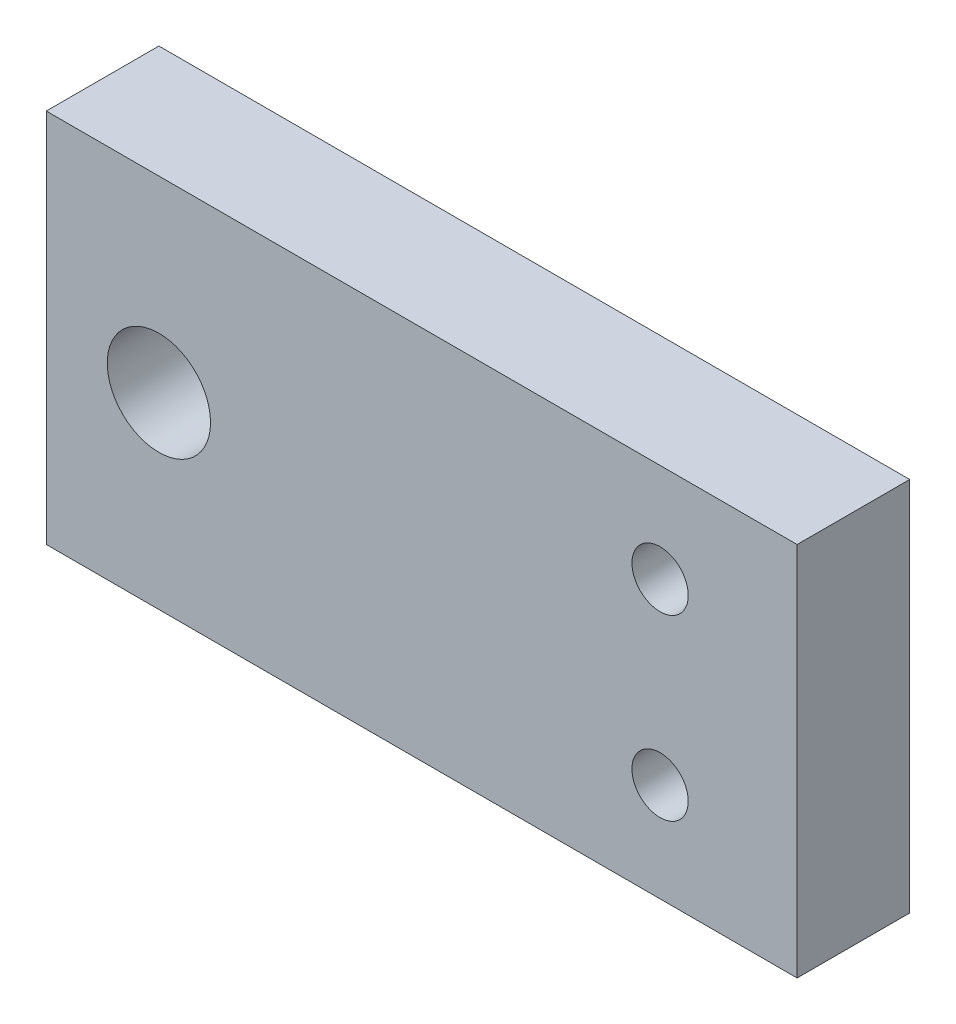
ISO-10303-21;
HEADER;
FILE_DESCRIPTION(('STEP AP214'),'2;1');
FILE_NAME('part.step','',(''),(''),'','','');
FILE_SCHEMA(('AUTOMOTIVE_DESIGN { 1 0 10303 214 1 1 1 1 }'));
ENDSEC;
DATA;
#1=APPLICATION_CONTEXT('core data for automotive mechanical design processes');
#2=APPLICATION_PROTOCOL_DEFINITION('international standard','automotive_design',2000,#1);
#3=PRODUCT_CONTEXT('',#1,'mechanical');
#4=PRODUCT('Part','Part','',(#3));
#5=PRODUCT_RELATED_PRODUCT_CATEGORY('part','',(#4));
#6=PRODUCT_DEFINITION_FORMATION('','',#4);
#7=PRODUCT_DEFINITION_CONTEXT('part definition',#1,'design');
#8=PRODUCT_DEFINITION('design','',#6,#7);
#9=PRODUCT_DEFINITION_SHAPE('','',#8);
#10=(LENGTH_UNIT() NAMED_UNIT(*) SI_UNIT(.MILLI.,.METRE.));
#11=(NAMED_UNIT(*) PLANE_ANGLE_UNIT() SI_UNIT($,.RADIAN.));
#12=(NAMED_UNIT(*) SI_UNIT($,.STERADIAN.) SOLID_ANGLE_UNIT());
#13=UNCERTAINTY_MEASURE_WITH_UNIT(LENGTH_MEASURE(1.E-05),#10,'distance_accuracy_value','');
#14=(GEOMETRIC_REPRESENTATION_CONTEXT(3) GLOBAL_UNCERTAINTY_ASSIGNED_CONTEXT((#13)) GLOBAL_UNIT_ASSIGNED_CONTEXT((#10,
#11,#12)) REPRESENTATION_CONTEXT('',''));
#15=CARTESIAN_POINT('',(0.,0.,0.));
#16=DIRECTION('',(0.,0.,1.));
#17=DIRECTION('',(1.,0.,0.));
#18=AXIS2_PLACEMENT_3D('',#15,#16,#17);
#19=CARTESIAN_POINT('',(32.7,-4.75000000000001,-1.5));
#20=DIRECTION('',(0.,0.,1.));
#21=DIRECTION('',(1.,0.,0.));
#22=AXIS2_PLACEMENT_3D('',#19,#20,#21);
#23=CYLINDRICAL_SURFACE('',#22,1.5);
#24=CARTESIAN_POINT('',(32.7,-4.75000000000001,6.));
#25=DIRECTION('',(0.,0.,1.));
#26=DIRECTION('',(1.,0.,0.));
#27=AXIS2_PLACEMENT_3D('',#24,#25,#26);
#28=CIRCLE('',#27,1.5);
#29=CARTESIAN_POINT('',(34.2,-4.75000000000001,6.));
#30=VERTEX_POINT('',#29);
#31=EDGE_CURVE('E273',#30,#30,#28,.T.);
#32=ORIENTED_EDGE('',*,*,#31,.T.);
#33=EDGE_LOOP('',(#32));
#34=FACE_BOUND('',#33,.T.);
#35=CARTESIAN_POINT('',(32.7,-4.75000000000001,2.));
#36=DIRECTION('',(0.,0.,-1.));
#37=DIRECTION('',(-1.,0.,0.));
#38=AXIS2_PLACEMENT_3D('',#35,#36,#37);
#39=CIRCLE('',#38,1.5);
#40=CARTESIAN_POINT('',(31.2,-4.75000000000001,2.));
#41=VERTEX_POINT('',#40);
#42=EDGE_CURVE('E36',#41,#41,#39,.F.);
#43=ORIENTED_EDGE('',*,*,#42,.F.);
#44=EDGE_LOOP('',(#43));
#45=FACE_BOUND('',#44,.T.);
#46=ADVANCED_FACE('F32',(#34,#45),#23,.F.);
#47=CARTESIAN_POINT('',(32.7,4.74999999999999,-1.5));
#48=DIRECTION('',(0.,0.,1.));
#49=DIRECTION('',(1.,0.,0.));
#50=AXIS2_PLACEMENT_3D('',#47,#48,#49);
#51=CYLINDRICAL_SURFACE('',#50,1.5);
#52=CARTESIAN_POINT('',(32.7,4.74999999999999,6.));
#53=DIRECTION('',(0.,0.,1.));
#54=DIRECTION('',(1.,0.,0.));
#55=AXIS2_PLACEMENT_3D('',#52,#53,#54);
#56=CIRCLE('',#55,1.5);
#57=CARTESIAN_POINT('',(34.2,4.74999999999999,6.));
#58=VERTEX_POINT('',#57);
#59=EDGE_CURVE('E276',#58,#58,#56,.T.);
#60=ORIENTED_EDGE('',*,*,#59,.T.);
#61=EDGE_LOOP('',(#60));
#62=FACE_BOUND('',#61,.T.);
#63=CARTESIAN_POINT('',(32.7,4.74999999999999,2.));
#64=DIRECTION('',(0.,0.,-1.));
#65=DIRECTION('',(-1.,0.,0.));
#66=AXIS2_PLACEMENT_3D('',#63,#64,#65);
#67=CIRCLE('',#66,1.5);
#68=CARTESIAN_POINT('',(31.2,4.74999999999999,2.));
#69=VERTEX_POINT('',#68);
#70=EDGE_CURVE('E263',#69,#69,#67,.F.);
#71=ORIENTED_EDGE('',*,*,#70,.F.);
#72=EDGE_LOOP('',(#71));
#73=FACE_BOUND('',#72,.T.);
#74=ADVANCED_FACE('F348',(#62,#73),#51,.F.);
#75=CARTESIAN_POINT('',(0.,0.,0.));
#76=DIRECTION('',(0.,0.,1.));
#77=DIRECTION('',(1.,0.,0.));
#78=AXIS2_PLACEMENT_3D('',#75,#76,#77);
#79=PLANE('',#78);
#80=DIRECTION('',(0.500000000000001,0.866025403784438,0.));
#81=VECTOR('',#80,1.);
#82=CARTESIAN_POINT('',(29.5245735194571,-4.75000000000001,0.));
#83=LINE('',#82,#81);
#84=CARTESIAN_POINT('',(29.5245735194571,-4.75000000000001,0.));
#85=VERTEX_POINT('',#84);
#86=CARTESIAN_POINT('',(31.1122867597285,-2.00000000000001,0.));
#87=VERTEX_POINT('',#86);
#88=EDGE_CURVE('E207',#85,#87,#83,.T.);
#89=ORIENTED_EDGE('',*,*,#88,.F.);
#90=DIRECTION('',(-0.5,0.866025403784439,0.));
#91=VECTOR('',#90,1.);
#92=CARTESIAN_POINT('',(31.1122867597285,-7.50000000000002,0.));
#93=LINE('',#92,#91);
#94=CARTESIAN_POINT('',(31.1122867597285,-7.50000000000002,0.));
#95=VERTEX_POINT('',#94);
#96=EDGE_CURVE('E49',#95,#85,#93,.T.);
#97=ORIENTED_EDGE('',*,*,#96,.F.);
#98=DIRECTION('',(-1.,0.,0.));
#99=VECTOR('',#98,1.);
#100=CARTESIAN_POINT('',(34.2877132402715,-7.50000000000002,0.));
#101=LINE('',#100,#99);
#102=CARTESIAN_POINT('',(34.2877132402715,-7.50000000000002,0.));
#103=VERTEX_POINT('',#102);
#104=EDGE_CURVE('E193',#103,#95,#101,.T.);
#105=ORIENTED_EDGE('',*,*,#104,.F.);
#106=DIRECTION('',(-0.5,-0.866025403784439,0.));
#107=VECTOR('',#106,1.);
#108=CARTESIAN_POINT('',(35.875426480543,-4.75000000000001,0.));
#109=LINE('',#108,#107);
#110=CARTESIAN_POINT('',(35.875426480543,-4.75000000000001,0.));
#111=VERTEX_POINT('',#110);
#112=EDGE_CURVE('E196',#111,#103,#109,.T.);
#113=ORIENTED_EDGE('',*,*,#112,.F.);
#114=DIRECTION('',(0.499999999999999,-0.866025403784439,0.));
#115=VECTOR('',#114,1.);
#116=CARTESIAN_POINT('',(34.2877132402715,-2.00000000000001,0.));
#117=LINE('',#116,#115);
#118=CARTESIAN_POINT('',(34.2877132402715,-2.00000000000001,0.));
#119=VERTEX_POINT('',#118);
#120=EDGE_CURVE('E212',#119,#111,#117,.T.);
#121=ORIENTED_EDGE('',*,*,#120,.F.);
#122=DIRECTION('',(1.,0.,0.));
#123=VECTOR('',#122,1.);
#124=CARTESIAN_POINT('',(31.1122867597285,-2.00000000000001,0.));
#125=LINE('',#124,#123);
#126=EDGE_CURVE('E209',#87,#119,#125,.T.);
#127=ORIENTED_EDGE('',*,*,#126,.F.);
#128=EDGE_LOOP('',(#89,#97,#105,#113,#121,#127));
#129=FACE_BOUND('',#128,.T.);
#130=DIRECTION('',(0.5,0.866025403784439,0.));
#131=VECTOR('',#130,1.);
#132=CARTESIAN_POINT('',(29.5245735194571,4.74999999999999,0.));
#133=LINE('',#132,#131);
#134=CARTESIAN_POINT('',(29.5245735194571,4.74999999999998,0.));
#135=VERTEX_POINT('',#134);
#136=CARTESIAN_POINT('',(31.1122867597285,7.49999999999999,0.));
#137=VERTEX_POINT('',#136);
#138=EDGE_CURVE('E247',#135,#137,#133,.T.);
#139=ORIENTED_EDGE('',*,*,#138,.F.);
#140=DIRECTION('',(-0.499999999999999,0.866025403784439,0.));
#141=VECTOR('',#140,1.);
#142=CARTESIAN_POINT('',(31.1122867597285,1.99999999999999,0.));
#143=LINE('',#142,#141);
#144=CARTESIAN_POINT('',(31.1122867597285,1.99999999999999,0.));
#145=VERTEX_POINT('',#144);
#146=EDGE_CURVE('E57',#145,#135,#143,.T.);
#147=ORIENTED_EDGE('',*,*,#146,.F.);
#148=DIRECTION('',(-1.,0.,0.));
#149=VECTOR('',#148,1.);
#150=CARTESIAN_POINT('',(34.2877132402715,1.99999999999999,0.));
#151=LINE('',#150,#149);
#152=CARTESIAN_POINT('',(34.2877132402715,1.99999999999999,0.));
#153=VERTEX_POINT('',#152);
#154=EDGE_CURVE('E230',#153,#145,#151,.T.);
#155=ORIENTED_EDGE('',*,*,#154,.F.);
#156=DIRECTION('',(-0.500000000000002,-0.866025403784438,0.));
#157=VECTOR('',#156,1.);
#158=CARTESIAN_POINT('',(35.875426480543,4.74999999999998,0.));
#159=LINE('',#158,#157);
#160=CARTESIAN_POINT('',(35.875426480543,4.74999999999998,0.));
#161=VERTEX_POINT('',#160);
#162=EDGE_CURVE('E256',#161,#153,#159,.T.);
#163=ORIENTED_EDGE('',*,*,#162,.F.);
#164=DIRECTION('',(0.500000000000002,-0.866025403784437,0.));
#165=VECTOR('',#164,1.);
#166=CARTESIAN_POINT('',(34.2877132402715,7.49999999999999,0.));
#167=LINE('',#166,#165);
#168=CARTESIAN_POINT('',(34.2877132402715,7.49999999999999,0.));
#169=VERTEX_POINT('',#168);
#170=EDGE_CURVE('E253',#169,#161,#167,.T.);
#171=ORIENTED_EDGE('',*,*,#170,.F.);
#172=DIRECTION('',(1.,0.,0.));
#173=VECTOR('',#172,1.);
#174=CARTESIAN_POINT('',(31.1122867597285,7.49999999999999,0.));
#175=LINE('',#174,#173);
#176=EDGE_CURVE('E250',#137,#169,#175,.T.);
#177=ORIENTED_EDGE('',*,*,#176,.F.);
#178=EDGE_LOOP('',(#139,#147,#155,#163,#171,#177));
#179=FACE_BOUND('',#178,.T.);
#180=CARTESIAN_POINT('',(6.,0.,0.));
#181=DIRECTION('',(0.,0.,1.));
#182=DIRECTION('',(1.,0.,0.));
#183=AXIS2_PLACEMENT_3D('',#180,#181,#182);
#184=CIRCLE('',#183,2.75);
#185=CARTESIAN_POINT('',(8.75,0.,0.));
#186=VERTEX_POINT('',#185);
#187=EDGE_CURVE('E282',#186,#186,#184,.T.);
#188=ORIENTED_EDGE('',*,*,#187,.T.);
#189=EDGE_LOOP('',(#188));
#190=FACE_BOUND('',#189,.T.);
#191=DIRECTION('',(0.,-1.,0.));
#192=VECTOR('',#191,1.);
#193=CARTESIAN_POINT('',(0.,10.,0.));
#194=LINE('',#193,#192);
#195=CARTESIAN_POINT('',(0.,10.,0.));
#196=VERTEX_POINT('',#195);
#197=CARTESIAN_POINT('',(0.,-10.,0.));
#198=VERTEX_POINT('',#197);
#199=EDGE_CURVE('E318',#196,#198,#194,.T.);
#200=ORIENTED_EDGE('',*,*,#199,.F.);
#201=DIRECTION('',(-1.,0.,0.));
#202=VECTOR('',#201,1.);
#203=CARTESIAN_POINT('',(0.,10.,0.));
#204=LINE('',#203,#202);
#205=CARTESIAN_POINT('',(40.,10.,0.));
#206=VERTEX_POINT('',#205);
#207=EDGE_CURVE('E323',#206,#196,#204,.T.);
#208=ORIENTED_EDGE('',*,*,#207,.F.);
#209=DIRECTION('',(0.,1.,0.));
#210=VECTOR('',#209,1.);
#211=CARTESIAN_POINT('',(40.,10.,0.));
#212=LINE('',#211,#210);
#213=CARTESIAN_POINT('',(40.,-10.,0.));
#214=VERTEX_POINT('',#213);
#215=EDGE_CURVE('E334',#214,#206,#212,.T.);
#216=ORIENTED_EDGE('',*,*,#215,.F.);
#217=DIRECTION('',(1.,0.,0.));
#218=VECTOR('',#217,1.);
#219=CARTESIAN_POINT('',(0.,-10.,0.));
#220=LINE('',#219,#218);
#221=EDGE_CURVE('E332',#198,#214,#220,.T.);
#222=ORIENTED_EDGE('',*,*,#221,.F.);
#223=EDGE_LOOP('',(#200,#208,#216,#222));
#224=FACE_BOUND('',#223,.T.);
#225=DIRECTION('',(0.,-1.,0.));
#226=VECTOR('',#225,1.);
#227=CARTESIAN_POINT('',(29.,2.25,0.));
#228=LINE('',#227,#226);
#229=CARTESIAN_POINT('',(29.,2.25,0.));
#230=VERTEX_POINT('',#229);
#231=CARTESIAN_POINT('',(29.,-2.25,0.));
#232=VERTEX_POINT('',#231);
#233=EDGE_CURVE('E285',#230,#232,#228,.T.);
#234=ORIENTED_EDGE('',*,*,#233,.F.);
#235=DIRECTION('',(1.,0.,0.));
#236=VECTOR('',#235,1.);
#237=CARTESIAN_POINT('',(29.,2.25,0.));
#238=LINE('',#237,#236);
#239=CARTESIAN_POINT('',(11.,2.25,0.));
#240=VERTEX_POINT('',#239);
#241=EDGE_CURVE('E290',#240,#230,#238,.T.);
#242=ORIENTED_EDGE('',*,*,#241,.F.);
#243=DIRECTION('',(0.,1.,0.));
#244=VECTOR('',#243,1.);
#245=CARTESIAN_POINT('',(11.,2.25,0.));
#246=LINE('',#245,#244);
#247=CARTESIAN_POINT('',(11.,-2.25,0.));
#248=VERTEX_POINT('',#247);
#249=EDGE_CURVE('E302',#248,#240,#246,.T.);
#250=ORIENTED_EDGE('',*,*,#249,.F.);
#251=DIRECTION('',(-1.,0.,0.));
#252=VECTOR('',#251,1.);
#253=CARTESIAN_POINT('',(29.,-2.25,0.));
#254=LINE('',#253,#252);
#255=EDGE_CURVE('E299',#232,#248,#254,.T.);
#256=ORIENTED_EDGE('',*,*,#255,.F.);
#257=EDGE_LOOP('',(#234,#242,#250,#256));
#258=FACE_BOUND('',#257,.T.);
#259=ADVANCED_FACE('F350',(#129,#179,#190,#224,#258),#79,.F.);
#260=CARTESIAN_POINT('',(0.,10.,6.));
#261=DIRECTION('',(1.,0.,0.));
#262=DIRECTION('',(0.,0.,-1.));
#263=AXIS2_PLACEMENT_3D('',#260,#261,#262);
#264=PLANE('',#263);
#265=ORIENTED_EDGE('',*,*,#199,.T.);
#266=DIRECTION('',(0.,0.,-1.));
#267=VECTOR('',#266,1.);
#268=CARTESIAN_POINT('',(0.,-10.,6.));
#269=LINE('',#268,#267);
#270=CARTESIAN_POINT('',(0.,-10.,6.));
#271=VERTEX_POINT('',#270);
#272=EDGE_CURVE('E11',#271,#198,#269,.T.);
#273=ORIENTED_EDGE('',*,*,#272,.F.);
#274=DIRECTION('',(0.,-1.,0.));
#275=VECTOR('',#274,1.);
#276=CARTESIAN_POINT('',(0.,10.,6.));
#277=LINE('',#276,#275);
#278=CARTESIAN_POINT('',(0.,10.,6.));
#279=VERTEX_POINT('',#278);
#280=EDGE_CURVE('E319',#279,#271,#277,.T.);
#281=ORIENTED_EDGE('',*,*,#280,.F.);
#282=DIRECTION('',(0.,0.,-1.));
#283=VECTOR('',#282,1.);
#284=CARTESIAN_POINT('',(0.,10.,6.));
#285=LINE('',#284,#283);
#286=EDGE_CURVE('E329',#279,#196,#285,.T.);
#287=ORIENTED_EDGE('',*,*,#286,.T.);
#288=EDGE_LOOP('',(#265,#273,#281,#287));
#289=FACE_BOUND('',#288,.T.);
#290=ADVANCED_FACE('F34',(#289),#264,.F.);
#291=CARTESIAN_POINT('',(0.,-10.,6.));
#292=DIRECTION('',(0.,1.,0.));
#293=DIRECTION('',(0.,0.,1.));
#294=AXIS2_PLACEMENT_3D('',#291,#292,#293);
#295=PLANE('',#294);
#296=ORIENTED_EDGE('',*,*,#221,.T.);
#297=DIRECTION('',(0.,0.,-1.));
#298=VECTOR('',#297,1.);
#299=CARTESIAN_POINT('',(40.,-10.,6.));
#300=LINE('',#299,#298);
#301=CARTESIAN_POINT('',(40.,-10.,6.));
#302=VERTEX_POINT('',#301);
#303=EDGE_CURVE('E41',#302,#214,#300,.T.);
#304=ORIENTED_EDGE('',*,*,#303,.F.);
#305=DIRECTION('',(1.,0.,0.));
#306=VECTOR('',#305,1.);
#307=CARTESIAN_POINT('',(0.,-10.,6.));
#308=LINE('',#307,#306);
#309=EDGE_CURVE('E322',#271,#302,#308,.T.);
#310=ORIENTED_EDGE('',*,*,#309,.F.);
#311=ORIENTED_EDGE('',*,*,#272,.T.);
#312=EDGE_LOOP('',(#296,#304,#310,#311));
#313=FACE_BOUND('',#312,.T.);
#314=ADVANCED_FACE('F397',(#313),#295,.F.);
#315=CARTESIAN_POINT('',(40.,10.,6.));
#316=DIRECTION('',(-1.,0.,0.));
#317=DIRECTION('',(0.,0.,1.));
#318=AXIS2_PLACEMENT_3D('',#315,#316,#317);
#319=PLANE('',#318);
#320=ORIENTED_EDGE('',*,*,#215,.T.);
#321=DIRECTION('',(0.,0.,-1.));
#322=VECTOR('',#321,1.);
#323=CARTESIAN_POINT('',(40.,10.,6.));
#324=LINE('',#323,#322);
#325=CARTESIAN_POINT('',(40.,10.,6.));
#326=VERTEX_POINT('',#325);
#327=EDGE_CURVE('E339',#326,#206,#324,.T.);
#328=ORIENTED_EDGE('',*,*,#327,.F.);
#329=DIRECTION('',(0.,1.,0.));
#330=VECTOR('',#329,1.);
#331=CARTESIAN_POINT('',(40.,10.,6.));
#332=LINE('',#331,#330);
#333=EDGE_CURVE('E325',#302,#326,#332,.T.);
#334=ORIENTED_EDGE('',*,*,#333,.F.);
#335=ORIENTED_EDGE('',*,*,#303,.T.);
#336=EDGE_LOOP('',(#320,#328,#334,#335));
#337=FACE_BOUND('',#336,.T.);
#338=ADVANCED_FACE('F394',(#337),#319,.F.);
#339=CARTESIAN_POINT('',(0.,10.,6.));
#340=DIRECTION('',(0.,-1.,0.));
#341=DIRECTION('',(0.,0.,-1.));
#342=AXIS2_PLACEMENT_3D('',#339,#340,#341);
#343=PLANE('',#342);
#344=ORIENTED_EDGE('',*,*,#207,.T.);
#345=ORIENTED_EDGE('',*,*,#286,.F.);
#346=DIRECTION('',(-1.,0.,0.));
#347=VECTOR('',#346,1.);
#348=CARTESIAN_POINT('',(0.,10.,6.));
#349=LINE('',#348,#347);
#350=EDGE_CURVE('E327',#326,#279,#349,.T.);
#351=ORIENTED_EDGE('',*,*,#350,.F.);
#352=ORIENTED_EDGE('',*,*,#327,.T.);
#353=EDGE_LOOP('',(#344,#345,#351,#352));
#354=FACE_BOUND('',#353,.T.);
#355=ADVANCED_FACE('F389',(#354),#343,.F.);
#356=CARTESIAN_POINT('',(0.,0.,6.));
#357=DIRECTION('',(0.,0.,1.));
#358=DIRECTION('',(1.,0.,0.));
#359=AXIS2_PLACEMENT_3D('',#356,#357,#358);
#360=PLANE('',#359);
#361=ORIENTED_EDGE('',*,*,#31,.F.);
#362=EDGE_LOOP('',(#361));
#363=FACE_BOUND('',#362,.T.);
#364=ORIENTED_EDGE('',*,*,#59,.F.);
#365=EDGE_LOOP('',(#364));
#366=FACE_BOUND('',#365,.T.);
#367=CARTESIAN_POINT('',(6.,0.,6.));
#368=DIRECTION('',(0.,0.,1.));
#369=DIRECTION('',(1.,0.,0.));
#370=AXIS2_PLACEMENT_3D('',#367,#368,#369);
#371=CIRCLE('',#370,2.75);
#372=CARTESIAN_POINT('',(8.75,0.,6.));
#373=VERTEX_POINT('',#372);
#374=EDGE_CURVE('E279',#373,#373,#371,.T.);
#375=ORIENTED_EDGE('',*,*,#374,.F.);
#376=EDGE_LOOP('',(#375));
#377=FACE_BOUND('',#376,.T.);
#378=ORIENTED_EDGE('',*,*,#280,.T.);
#379=ORIENTED_EDGE('',*,*,#309,.T.);
#380=ORIENTED_EDGE('',*,*,#333,.T.);
#381=ORIENTED_EDGE('',*,*,#350,.T.);
#382=EDGE_LOOP('',(#378,#379,#380,#381));
#383=FACE_BOUND('',#382,.T.);
#384=ADVANCED_FACE('F386',(#363,#366,#377,#383),#360,.T.);
#385=CARTESIAN_POINT('',(29.,2.25,-1.5));
#386=DIRECTION('',(-1.,0.,0.));
#387=DIRECTION('',(0.,0.,1.));
#388=AXIS2_PLACEMENT_3D('',#385,#386,#387);
#389=PLANE('',#388);
#390=ORIENTED_EDGE('',*,*,#233,.T.);
#391=DIRECTION('',(0.,0.,1.));
#392=VECTOR('',#391,1.);
#393=CARTESIAN_POINT('',(29.,-2.25,-1.5));
#394=LINE('',#393,#392);
#395=CARTESIAN_POINT('',(29.,-2.25,-1.5));
#396=VERTEX_POINT('',#395);
#397=EDGE_CURVE('E315',#396,#232,#394,.T.);
#398=ORIENTED_EDGE('',*,*,#397,.F.);
#399=DIRECTION('',(0.,-1.,0.));
#400=VECTOR('',#399,1.);
#401=CARTESIAN_POINT('',(29.,2.25,-1.5));
#402=LINE('',#401,#400);
#403=CARTESIAN_POINT('',(29.,2.25,-1.5));
#404=VERTEX_POINT('',#403);
#405=EDGE_CURVE('E286',#404,#396,#402,.T.);
#406=ORIENTED_EDGE('',*,*,#405,.F.);
#407=DIRECTION('',(0.,0.,1.));
#408=VECTOR('',#407,1.);
#409=CARTESIAN_POINT('',(29.,2.25,-1.5));
#410=LINE('',#409,#408);
#411=EDGE_CURVE('E296',#404,#230,#410,.T.);
#412=ORIENTED_EDGE('',*,*,#411,.T.);
#413=EDGE_LOOP('',(#390,#398,#406,#412));
#414=FACE_BOUND('',#413,.T.);
#415=ADVANCED_FACE('F382',(#414),#389,.F.);
#416=CARTESIAN_POINT('',(29.,-2.25,-1.5));
#417=DIRECTION('',(0.,1.,0.));
#418=DIRECTION('',(-1.,0.,0.));
#419=AXIS2_PLACEMENT_3D('',#416,#417,#418);
#420=PLANE('',#419);
#421=ORIENTED_EDGE('',*,*,#255,.T.);
#422=DIRECTION('',(0.,0.,1.));
#423=VECTOR('',#422,1.);
#424=CARTESIAN_POINT('',(11.,-2.25,-1.5));
#425=LINE('',#424,#423);
#426=CARTESIAN_POINT('',(11.,-2.25,-1.5));
#427=VERTEX_POINT('',#426);
#428=EDGE_CURVE('E312',#427,#248,#425,.T.);
#429=ORIENTED_EDGE('',*,*,#428,.F.);
#430=DIRECTION('',(-1.,0.,0.));
#431=VECTOR('',#430,1.);
#432=CARTESIAN_POINT('',(29.,-2.25,-1.5));
#433=LINE('',#432,#431);
#434=EDGE_CURVE('E289',#396,#427,#433,.T.);
#435=ORIENTED_EDGE('',*,*,#434,.F.);
#436=ORIENTED_EDGE('',*,*,#397,.T.);
#437=EDGE_LOOP('',(#421,#429,#435,#436));
#438=FACE_BOUND('',#437,.T.);
#439=ADVANCED_FACE('F378',(#438),#420,.F.);
#440=CARTESIAN_POINT('',(11.,2.25,-1.5));
#441=DIRECTION('',(1.,0.,0.));
#442=DIRECTION('',(0.,0.,-1.));
#443=AXIS2_PLACEMENT_3D('',#440,#441,#442);
#444=PLANE('',#443);
#445=ORIENTED_EDGE('',*,*,#249,.T.);
#446=DIRECTION('',(0.,0.,1.));
#447=VECTOR('',#446,1.);
#448=CARTESIAN_POINT('',(11.,2.25,-1.5));
#449=LINE('',#448,#447);
#450=CARTESIAN_POINT('',(11.,2.25,-1.5));
#451=VERTEX_POINT('',#450);
#452=EDGE_CURVE('E309',#451,#240,#449,.T.);
#453=ORIENTED_EDGE('',*,*,#452,.F.);
#454=DIRECTION('',(0.,1.,0.));
#455=VECTOR('',#454,1.);
#456=CARTESIAN_POINT('',(11.,2.25,-1.5));
#457=LINE('',#456,#455);
#458=EDGE_CURVE('E292',#427,#451,#457,.T.);
#459=ORIENTED_EDGE('',*,*,#458,.F.);
#460=ORIENTED_EDGE('',*,*,#428,.T.);
#461=EDGE_LOOP('',(#445,#453,#459,#460));
#462=FACE_BOUND('',#461,.T.);
#463=ADVANCED_FACE('F374',(#462),#444,.F.);
#464=CARTESIAN_POINT('',(29.,2.25,-1.5));
#465=DIRECTION('',(0.,-1.,0.));
#466=DIRECTION('',(0.,0.,-1.));
#467=AXIS2_PLACEMENT_3D('',#464,#465,#466);
#468=PLANE('',#467);
#469=ORIENTED_EDGE('',*,*,#241,.T.);
#470=ORIENTED_EDGE('',*,*,#411,.F.);
#471=DIRECTION('',(1.,0.,0.));
#472=VECTOR('',#471,1.);
#473=CARTESIAN_POINT('',(29.,2.25,-1.5));
#474=LINE('',#473,#472);
#475=EDGE_CURVE('E294',#451,#404,#474,.T.);
#476=ORIENTED_EDGE('',*,*,#475,.F.);
#477=ORIENTED_EDGE('',*,*,#452,.T.);
#478=EDGE_LOOP('',(#469,#470,#476,#477));
#479=FACE_BOUND('',#478,.T.);
#480=ADVANCED_FACE('F370',(#479),#468,.F.);
#481=CARTESIAN_POINT('',(0.,0.,-1.5));
#482=DIRECTION('',(0.,0.,-1.));
#483=DIRECTION('',(-1.,0.,0.));
#484=AXIS2_PLACEMENT_3D('',#481,#482,#483);
#485=PLANE('',#484);
#486=ORIENTED_EDGE('',*,*,#405,.T.);
#487=ORIENTED_EDGE('',*,*,#434,.T.);
#488=ORIENTED_EDGE('',*,*,#458,.T.);
#489=ORIENTED_EDGE('',*,*,#475,.T.);
#490=EDGE_LOOP('',(#486,#487,#488,#489));
#491=FACE_BOUND('',#490,.T.);
#492=ADVANCED_FACE('F366',(#491),#485,.T.);
#493=CARTESIAN_POINT('',(6.,0.,-1.5));
#494=DIRECTION('',(0.,0.,1.));
#495=DIRECTION('',(1.,0.,0.));
#496=AXIS2_PLACEMENT_3D('',#493,#494,#495);
#497=CYLINDRICAL_SURFACE('',#496,2.75);
#498=ORIENTED_EDGE('',*,*,#374,.T.);
#499=EDGE_LOOP('',(#498));
#500=FACE_BOUND('',#499,.T.);
#501=ORIENTED_EDGE('',*,*,#187,.F.);
#502=EDGE_LOOP('',(#501));
#503=FACE_BOUND('',#502,.T.);
#504=ADVANCED_FACE('F363',(#500,#503),#497,.F.);
#505=CARTESIAN_POINT('',(0.,0.,2.));
#506=DIRECTION('',(0.,0.,-1.));
#507=DIRECTION('',(-1.,0.,0.));
#508=AXIS2_PLACEMENT_3D('',#505,#506,#507);
#509=PLANE('',#508);
#510=DIRECTION('',(-0.499999999999999,0.866025403784439,0.));
#511=VECTOR('',#510,1.);
#512=CARTESIAN_POINT('',(31.1122867597285,1.99999999999999,2.));
#513=LINE('',#512,#511);
#514=CARTESIAN_POINT('',(31.1122867597285,1.99999999999999,2.));
#515=VERTEX_POINT('',#514);
#516=CARTESIAN_POINT('',(29.5245735194571,4.74999999999999,2.));
#517=VERTEX_POINT('',#516);
#518=EDGE_CURVE('E226',#515,#517,#513,.T.);
#519=ORIENTED_EDGE('',*,*,#518,.T.);
#520=DIRECTION('',(0.5,0.866025403784439,0.));
#521=VECTOR('',#520,1.);
#522=CARTESIAN_POINT('',(29.5245735194571,4.74999999999999,2.));
#523=LINE('',#522,#521);
#524=CARTESIAN_POINT('',(31.1122867597285,7.49999999999999,2.));
#525=VERTEX_POINT('',#524);
#526=EDGE_CURVE('E229',#517,#525,#523,.T.);
#527=ORIENTED_EDGE('',*,*,#526,.T.);
#528=DIRECTION('',(1.,0.,0.));
#529=VECTOR('',#528,1.);
#530=CARTESIAN_POINT('',(31.1122867597285,7.49999999999999,2.));
#531=LINE('',#530,#529);
#532=CARTESIAN_POINT('',(34.2877132402715,7.49999999999999,2.));
#533=VERTEX_POINT('',#532);
#534=EDGE_CURVE('E233',#525,#533,#531,.T.);
#535=ORIENTED_EDGE('',*,*,#534,.T.);
#536=DIRECTION('',(0.500000000000002,-0.866025403784437,0.));
#537=VECTOR('',#536,1.);
#538=CARTESIAN_POINT('',(34.2877132402715,7.49999999999999,2.));
#539=LINE('',#538,#537);
#540=CARTESIAN_POINT('',(35.875426480543,4.74999999999998,2.));
#541=VERTEX_POINT('',#540);
#542=EDGE_CURVE('E236',#533,#541,#539,.T.);
#543=ORIENTED_EDGE('',*,*,#542,.T.);
#544=DIRECTION('',(-0.500000000000002,-0.866025403784438,0.));
#545=VECTOR('',#544,1.);
#546=CARTESIAN_POINT('',(35.875426480543,4.74999999999998,2.));
#547=LINE('',#546,#545);
#548=CARTESIAN_POINT('',(34.2877132402715,1.99999999999999,2.));
#549=VERTEX_POINT('',#548);
#550=EDGE_CURVE('E239',#541,#549,#547,.T.);
#551=ORIENTED_EDGE('',*,*,#550,.T.);
#552=DIRECTION('',(-1.,0.,0.));
#553=VECTOR('',#552,1.);
#554=CARTESIAN_POINT('',(34.2877132402715,1.99999999999999,2.));
#555=LINE('',#554,#553);
#556=EDGE_CURVE('E242',#549,#515,#555,.T.);
#557=ORIENTED_EDGE('',*,*,#556,.T.);
#558=EDGE_LOOP('',(#519,#527,#535,#543,#551,#557));
#559=FACE_BOUND('',#558,.T.);
#560=ORIENTED_EDGE('',*,*,#70,.T.);
#561=EDGE_LOOP('',(#560));
#562=FACE_BOUND('',#561,.T.);
#563=ADVANCED_FACE('F346',(#559,#562),#509,.T.);
#564=CARTESIAN_POINT('',(31.1122867597285,1.99999999999999,2.));
#565=DIRECTION('',(-0.866025403784439,-0.499999999999999,0.));
#566=DIRECTION('',(0.499999999999999,-0.866025403784439,0.));
#567=AXIS2_PLACEMENT_3D('',#564,#565,#566);
#568=PLANE('',#567);
#569=ORIENTED_EDGE('',*,*,#146,.T.);
#570=DIRECTION('',(0.,0.,-1.));
#571=VECTOR('',#570,1.);
#572=CARTESIAN_POINT('',(29.5245735194571,4.74999999999999,2.));
#573=LINE('',#572,#571);
#574=EDGE_CURVE('E245',#517,#135,#573,.T.);
#575=ORIENTED_EDGE('',*,*,#574,.F.);
#576=ORIENTED_EDGE('',*,*,#518,.F.);
#577=DIRECTION('',(0.,0.,-1.));
#578=VECTOR('',#577,1.);
#579=CARTESIAN_POINT('',(31.1122867597285,1.99999999999999,2.));
#580=LINE('',#579,#578);
#581=EDGE_CURVE('E261',#515,#145,#580,.T.);
#582=ORIENTED_EDGE('',*,*,#581,.T.);
#583=EDGE_LOOP('',(#569,#575,#576,#582));
#584=FACE_BOUND('',#583,.T.);
#585=ADVANCED_FACE('F445',(#584),#568,.F.);
#586=CARTESIAN_POINT('',(34.2877132402715,1.99999999999999,2.));
#587=DIRECTION('',(0.,-1.,0.));
#588=DIRECTION('',(1.,0.,0.));
#589=AXIS2_PLACEMENT_3D('',#586,#587,#588);
#590=PLANE('',#589);
#591=ORIENTED_EDGE('',*,*,#154,.T.);
#592=ORIENTED_EDGE('',*,*,#581,.F.);
#593=ORIENTED_EDGE('',*,*,#556,.F.);
#594=DIRECTION('',(0.,0.,-1.));
#595=VECTOR('',#594,1.);
#596=CARTESIAN_POINT('',(34.2877132402715,1.99999999999999,2.));
#597=LINE('',#596,#595);
#598=EDGE_CURVE('E264',#549,#153,#597,.T.);
#599=ORIENTED_EDGE('',*,*,#598,.T.);
#600=EDGE_LOOP('',(#591,#592,#593,#599));
#601=FACE_BOUND('',#600,.T.);
#602=ADVANCED_FACE('F456',(#601),#590,.F.);
#603=CARTESIAN_POINT('',(35.875426480543,4.74999999999998,2.));
#604=DIRECTION('',(0.866025403784438,-0.500000000000002,0.));
#605=DIRECTION('',(0.500000000000002,0.866025403784438,0.));
#606=AXIS2_PLACEMENT_3D('',#603,#604,#605);
#607=PLANE('',#606);
#608=ORIENTED_EDGE('',*,*,#162,.T.);
#609=ORIENTED_EDGE('',*,*,#598,.F.);
#610=ORIENTED_EDGE('',*,*,#550,.F.);
#611=DIRECTION('',(0.,0.,-1.));
#612=VECTOR('',#611,1.);
#613=CARTESIAN_POINT('',(35.875426480543,4.74999999999998,2.));
#614=LINE('',#613,#612);
#615=EDGE_CURVE('E266',#541,#161,#614,.T.);
#616=ORIENTED_EDGE('',*,*,#615,.T.);
#617=EDGE_LOOP('',(#608,#609,#610,#616));
#618=FACE_BOUND('',#617,.T.);
#619=ADVANCED_FACE('F464',(#618),#607,.F.);
#620=CARTESIAN_POINT('',(34.2877132402715,7.49999999999999,2.));
#621=DIRECTION('',(0.866025403784437,0.500000000000002,0.));
#622=DIRECTION('',(-0.500000000000002,0.866025403784437,0.));
#623=AXIS2_PLACEMENT_3D('',#620,#621,#622);
#624=PLANE('',#623);
#625=ORIENTED_EDGE('',*,*,#170,.T.);
#626=ORIENTED_EDGE('',*,*,#615,.F.);
#627=ORIENTED_EDGE('',*,*,#542,.F.);
#628=DIRECTION('',(0.,0.,-1.));
#629=VECTOR('',#628,1.);
#630=CARTESIAN_POINT('',(34.2877132402715,7.49999999999999,2.));
#631=LINE('',#630,#629);
#632=EDGE_CURVE('E268',#533,#169,#631,.T.);
#633=ORIENTED_EDGE('',*,*,#632,.T.);
#634=EDGE_LOOP('',(#625,#626,#627,#633));
#635=FACE_BOUND('',#634,.T.);
#636=ADVANCED_FACE('F474',(#635),#624,.F.);
#637=CARTESIAN_POINT('',(31.1122867597285,7.49999999999999,2.));
#638=DIRECTION('',(0.,1.,0.));
#639=DIRECTION('',(0.,0.,1.));
#640=AXIS2_PLACEMENT_3D('',#637,#638,#639);
#641=PLANE('',#640);
#642=ORIENTED_EDGE('',*,*,#176,.T.);
#643=ORIENTED_EDGE('',*,*,#632,.F.);
#644=ORIENTED_EDGE('',*,*,#534,.F.);
#645=DIRECTION('',(0.,0.,-1.));
#646=VECTOR('',#645,1.);
#647=CARTESIAN_POINT('',(31.1122867597285,7.49999999999999,2.));
#648=LINE('',#647,#646);
#649=EDGE_CURVE('E270',#525,#137,#648,.T.);
#650=ORIENTED_EDGE('',*,*,#649,.T.);
#651=EDGE_LOOP('',(#642,#643,#644,#650));
#652=FACE_BOUND('',#651,.T.);
#653=ADVANCED_FACE('F484',(#652),#641,.F.);
#654=CARTESIAN_POINT('',(29.5245735194571,4.74999999999999,2.));
#655=DIRECTION('',(-0.866025403784439,0.5,0.));
#656=DIRECTION('',(-0.5,-0.866025403784439,0.));
#657=AXIS2_PLACEMENT_3D('',#654,#655,#656);
#658=PLANE('',#657);
#659=ORIENTED_EDGE('',*,*,#138,.T.);
#660=ORIENTED_EDGE('',*,*,#649,.F.);
#661=ORIENTED_EDGE('',*,*,#526,.F.);
#662=ORIENTED_EDGE('',*,*,#574,.T.);
#663=EDGE_LOOP('',(#659,#660,#661,#662));
#664=FACE_BOUND('',#663,.T.);
#665=ADVANCED_FACE('F494',(#664),#658,.F.);
#666=CARTESIAN_POINT('',(0.,0.,2.));
#667=DIRECTION('',(0.,0.,-1.));
#668=DIRECTION('',(-1.,0.,0.));
#669=AXIS2_PLACEMENT_3D('',#666,#667,#668);
#670=PLANE('',#669);
#671=DIRECTION('',(-0.5,0.866025403784439,0.));
#672=VECTOR('',#671,1.);
#673=CARTESIAN_POINT('',(31.1122867597285,-7.50000000000002,2.));
#674=LINE('',#673,#672);
#675=CARTESIAN_POINT('',(31.1122867597285,-7.50000000000002,2.));
#676=VERTEX_POINT('',#675);
#677=CARTESIAN_POINT('',(29.5245735194571,-4.75000000000001,2.));
#678=VERTEX_POINT('',#677);
#679=EDGE_CURVE('E173',#676,#678,#674,.T.);
#680=ORIENTED_EDGE('',*,*,#679,.T.);
#681=DIRECTION('',(0.500000000000001,0.866025403784438,0.));
#682=VECTOR('',#681,1.);
#683=CARTESIAN_POINT('',(29.5245735194571,-4.75000000000001,2.));
#684=LINE('',#683,#682);
#685=CARTESIAN_POINT('',(31.1122867597285,-2.00000000000001,2.));
#686=VERTEX_POINT('',#685);
#687=EDGE_CURVE('E182',#678,#686,#684,.T.);
#688=ORIENTED_EDGE('',*,*,#687,.T.);
#689=DIRECTION('',(1.,0.,0.));
#690=VECTOR('',#689,1.);
#691=CARTESIAN_POINT('',(31.1122867597285,-2.00000000000001,2.));
#692=LINE('',#691,#690);
#693=CARTESIAN_POINT('',(34.2877132402715,-2.00000000000001,2.));
#694=VERTEX_POINT('',#693);
#695=EDGE_CURVE('E187',#686,#694,#692,.T.);
#696=ORIENTED_EDGE('',*,*,#695,.T.);
#697=DIRECTION('',(0.499999999999999,-0.866025403784439,0.));
#698=VECTOR('',#697,1.);
#699=CARTESIAN_POINT('',(34.2877132402715,-2.00000000000001,2.));
#700=LINE('',#699,#698);
#701=CARTESIAN_POINT('',(35.875426480543,-4.75000000000001,2.));
#702=VERTEX_POINT('',#701);
#703=EDGE_CURVE('E200',#694,#702,#700,.T.);
#704=ORIENTED_EDGE('',*,*,#703,.T.);
#705=DIRECTION('',(-0.5,-0.866025403784439,0.));
#706=VECTOR('',#705,1.);
#707=CARTESIAN_POINT('',(35.875426480543,-4.75000000000001,2.));
#708=LINE('',#707,#706);
#709=CARTESIAN_POINT('',(34.2877132402715,-7.50000000000002,2.));
#710=VERTEX_POINT('',#709);
#711=EDGE_CURVE('E203',#702,#710,#708,.T.);
#712=ORIENTED_EDGE('',*,*,#711,.T.);
#713=DIRECTION('',(-1.,0.,0.));
#714=VECTOR('',#713,1.);
#715=CARTESIAN_POINT('',(34.2877132402715,-7.50000000000002,2.));
#716=LINE('',#715,#714);
#717=EDGE_CURVE('E179',#710,#676,#716,.T.);
#718=ORIENTED_EDGE('',*,*,#717,.T.);
#719=EDGE_LOOP('',(#680,#688,#696,#704,#712,#718));
#720=FACE_BOUND('',#719,.T.);
#721=ORIENTED_EDGE('',*,*,#42,.T.);
#722=EDGE_LOOP('',(#721));
#723=FACE_BOUND('',#722,.T.);
#724=ADVANCED_FACE('F189',(#720,#723),#670,.T.);
#725=CARTESIAN_POINT('',(31.1122867597285,-7.50000000000002,2.));
#726=DIRECTION('',(-0.866025403784439,-0.5,0.));
#727=DIRECTION('',(0.5,-0.866025403784439,0.));
#728=AXIS2_PLACEMENT_3D('',#725,#726,#727);
#729=PLANE('',#728);
#730=ORIENTED_EDGE('',*,*,#96,.T.);
#731=DIRECTION('',(0.,0.,-1.));
#732=VECTOR('',#731,1.);
#733=CARTESIAN_POINT('',(29.5245735194571,-4.75000000000001,2.));
#734=LINE('',#733,#732);
#735=EDGE_CURVE('E169',#678,#85,#734,.T.);
#736=ORIENTED_EDGE('',*,*,#735,.F.);
#737=ORIENTED_EDGE('',*,*,#679,.F.);
#738=DIRECTION('',(0.,0.,-1.));
#739=VECTOR('',#738,1.);
#740=CARTESIAN_POINT('',(31.1122867597285,-7.50000000000002,2.));
#741=LINE('',#740,#739);
#742=EDGE_CURVE('E217',#676,#95,#741,.T.);
#743=ORIENTED_EDGE('',*,*,#742,.T.);
#744=EDGE_LOOP('',(#730,#736,#737,#743));
#745=FACE_BOUND('',#744,.T.);
#746=ADVANCED_FACE('F171',(#745),#729,.F.);
#747=CARTESIAN_POINT('',(34.2877132402715,-7.50000000000002,2.));
#748=DIRECTION('',(0.,-1.,0.));
#749=DIRECTION('',(1.,0.,0.));
#750=AXIS2_PLACEMENT_3D('',#747,#748,#749);
#751=PLANE('',#750);
#752=ORIENTED_EDGE('',*,*,#104,.T.);
#753=ORIENTED_EDGE('',*,*,#742,.F.);
#754=ORIENTED_EDGE('',*,*,#717,.F.);
#755=DIRECTION('',(0.,0.,-1.));
#756=VECTOR('',#755,1.);
#757=CARTESIAN_POINT('',(34.2877132402715,-7.50000000000002,2.));
#758=LINE('',#757,#756);
#759=EDGE_CURVE('E219',#710,#103,#758,.T.);
#760=ORIENTED_EDGE('',*,*,#759,.T.);
#761=EDGE_LOOP('',(#752,#753,#754,#760));
#762=FACE_BOUND('',#761,.T.);
#763=ADVANCED_FACE('F521',(#762),#751,.F.);
#764=CARTESIAN_POINT('',(35.875426480543,-4.75000000000001,2.));
#765=DIRECTION('',(0.866025403784439,-0.5,0.));
#766=DIRECTION('',(0.5,0.866025403784439,0.));
#767=AXIS2_PLACEMENT_3D('',#764,#765,#766);
#768=PLANE('',#767);
#769=ORIENTED_EDGE('',*,*,#112,.T.);
#770=ORIENTED_EDGE('',*,*,#759,.F.);
#771=ORIENTED_EDGE('',*,*,#711,.F.);
#772=DIRECTION('',(0.,0.,-1.));
#773=VECTOR('',#772,1.);
#774=CARTESIAN_POINT('',(35.875426480543,-4.75000000000001,2.));
#775=LINE('',#774,#773);
#776=EDGE_CURVE('E221',#702,#111,#775,.T.);
#777=ORIENTED_EDGE('',*,*,#776,.T.);
#778=EDGE_LOOP('',(#769,#770,#771,#777));
#779=FACE_BOUND('',#778,.T.);
#780=ADVANCED_FACE('F530',(#779),#768,.F.);
#781=CARTESIAN_POINT('',(34.2877132402715,-2.00000000000001,2.));
#782=DIRECTION('',(0.86602540378444,0.499999999999999,0.));
#783=DIRECTION('',(-0.499999999999999,0.866025403784439,0.));
#784=AXIS2_PLACEMENT_3D('',#781,#782,#783);
#785=PLANE('',#784);
#786=ORIENTED_EDGE('',*,*,#120,.T.);
#787=ORIENTED_EDGE('',*,*,#776,.F.);
#788=ORIENTED_EDGE('',*,*,#703,.F.);
#789=DIRECTION('',(0.,0.,-1.));
#790=VECTOR('',#789,1.);
#791=CARTESIAN_POINT('',(34.2877132402715,-2.00000000000001,2.));
#792=LINE('',#791,#790);
#793=EDGE_CURVE('E223',#694,#119,#792,.T.);
#794=ORIENTED_EDGE('',*,*,#793,.T.);
#795=EDGE_LOOP('',(#786,#787,#788,#794));
#796=FACE_BOUND('',#795,.T.);
#797=ADVANCED_FACE('F540',(#796),#785,.F.);
#798=CARTESIAN_POINT('',(31.1122867597285,-2.00000000000001,2.));
#799=DIRECTION('',(0.,1.,0.));
#800=DIRECTION('',(-1.,0.,0.));
#801=AXIS2_PLACEMENT_3D('',#798,#799,#800);
#802=PLANE('',#801);
#803=ORIENTED_EDGE('',*,*,#126,.T.);
#804=ORIENTED_EDGE('',*,*,#793,.F.);
#805=ORIENTED_EDGE('',*,*,#695,.F.);
#806=DIRECTION('',(0.,0.,-1.));
#807=VECTOR('',#806,1.);
#808=CARTESIAN_POINT('',(31.1122867597285,-2.00000000000001,2.));
#809=LINE('',#808,#807);
#810=EDGE_CURVE('E178',#686,#87,#809,.T.);
#811=ORIENTED_EDGE('',*,*,#810,.T.);
#812=EDGE_LOOP('',(#803,#804,#805,#811));
#813=FACE_BOUND('',#812,.T.);
#814=ADVANCED_FACE('F550',(#813),#802,.F.);
#815=CARTESIAN_POINT('',(29.5245735194571,-4.75000000000001,2.));
#816=DIRECTION('',(-0.866025403784438,0.500000000000001,0.));
#817=DIRECTION('',(-0.500000000000001,-0.866025403784438,0.));
#818=AXIS2_PLACEMENT_3D('',#815,#816,#817);
#819=PLANE('',#818);
#820=ORIENTED_EDGE('',*,*,#88,.T.);
#821=ORIENTED_EDGE('',*,*,#810,.F.);
#822=ORIENTED_EDGE('',*,*,#687,.F.);
#823=ORIENTED_EDGE('',*,*,#735,.T.);
#824=EDGE_LOOP('',(#820,#821,#822,#823));
#825=FACE_BOUND('',#824,.T.);
#826=ADVANCED_FACE('F183',(#825),#819,.F.);
#827=CLOSED_SHELL('',(#46,#74,#259,#290,#314,#338,#355,#384,#415,#439,#463,#480,#492,#504,#563,
#585,#602,#619,#636,#653,#665,#724,#746,#763,#780,#797,#814,#826));
#828=MANIFOLD_SOLID_BREP('B2',#827);
#829=ADVANCED_BREP_SHAPE_REPRESENTATION('',(#18,#828),#14);
#830=SHAPE_DEFINITION_REPRESENTATION(#9,#829);
ENDSEC;
END-ISO-10303-21;
